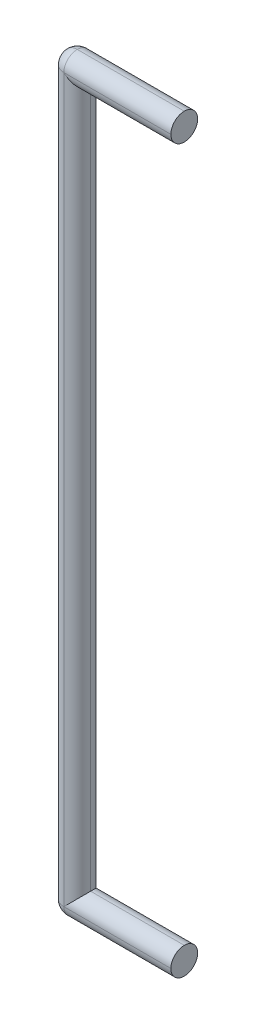
ISO-10303-21;
HEADER;
FILE_DESCRIPTION(('STEP AP214'),'2;1');
FILE_NAME('part.step','',(''),(''),'','','');
FILE_SCHEMA(('AUTOMOTIVE_DESIGN { 1 0 10303 214 1 1 1 1 }'));
ENDSEC;
DATA;
#1=APPLICATION_CONTEXT('core data for automotive mechanical design processes');
#2=APPLICATION_PROTOCOL_DEFINITION('international standard','automotive_design',2000,#1);
#3=PRODUCT_CONTEXT('',#1,'mechanical');
#4=PRODUCT('Part','Part','',(#3));
#5=PRODUCT_RELATED_PRODUCT_CATEGORY('part','',(#4));
#6=PRODUCT_DEFINITION_FORMATION('','',#4);
#7=PRODUCT_DEFINITION_CONTEXT('part definition',#1,'design');
#8=PRODUCT_DEFINITION('design','',#6,#7);
#9=PRODUCT_DEFINITION_SHAPE('','',#8);
#10=(LENGTH_UNIT() NAMED_UNIT(*) SI_UNIT(.MILLI.,.METRE.));
#11=(NAMED_UNIT(*) PLANE_ANGLE_UNIT() SI_UNIT($,.RADIAN.));
#12=(NAMED_UNIT(*) SI_UNIT($,.STERADIAN.) SOLID_ANGLE_UNIT());
#13=UNCERTAINTY_MEASURE_WITH_UNIT(LENGTH_MEASURE(1.E-05),#10,'distance_accuracy_value','');
#14=(GEOMETRIC_REPRESENTATION_CONTEXT(3) GLOBAL_UNCERTAINTY_ASSIGNED_CONTEXT((#13)) GLOBAL_UNIT_ASSIGNED_CONTEXT((#10,
#11,#12)) REPRESENTATION_CONTEXT('',''));
#15=CARTESIAN_POINT('',(0.,0.,0.));
#16=DIRECTION('',(0.,0.,1.));
#17=DIRECTION('',(1.,0.,0.));
#18=AXIS2_PLACEMENT_3D('',#15,#16,#17);
#19=CARTESIAN_POINT('',(4.,0.,0.));
#20=DIRECTION('',(-1.,0.,0.));
#21=DIRECTION('',(0.,0.,1.));
#22=AXIS2_PLACEMENT_3D('',#19,#20,#21);
#23=PLANE('',#22);
#24=CARTESIAN_POINT('',(4.,-0.5,0.));
#25=DIRECTION('',(-1.,0.,0.));
#26=DIRECTION('',(0.,0.,1.));
#27=AXIS2_PLACEMENT_3D('',#24,#25,#26);
#28=CIRCLE('',#27,0.5);
#29=CARTESIAN_POINT('',(4.,0.,0.));
#30=VERTEX_POINT('',#29);
#31=CARTESIAN_POINT('',(4.,-0.5,0.5));
#32=VERTEX_POINT('',#31);
#33=EDGE_CURVE('E109',#30,#32,#28,.F.);
#34=ORIENTED_EDGE('',*,*,#33,.T.);
#35=CARTESIAN_POINT('',(4.,-0.5,0.));
#36=DIRECTION('',(-1.,0.,0.));
#37=DIRECTION('',(0.,0.,1.));
#38=AXIS2_PLACEMENT_3D('',#35,#36,#37);
#39=CIRCLE('',#38,0.5);
#40=CARTESIAN_POINT('',(4.,-1.,0.));
#41=VERTEX_POINT('',#40);
#42=EDGE_CURVE('E113',#32,#41,#39,.F.);
#43=ORIENTED_EDGE('',*,*,#42,.T.);
#44=CARTESIAN_POINT('',(4.,-0.5,0.));
#45=DIRECTION('',(-1.,0.,0.));
#46=DIRECTION('',(0.,0.,1.));
#47=AXIS2_PLACEMENT_3D('',#44,#45,#46);
#48=CIRCLE('',#47,0.5);
#49=CARTESIAN_POINT('',(4.,-0.5,-0.5));
#50=VERTEX_POINT('',#49);
#51=EDGE_CURVE('E149',#41,#50,#48,.F.);
#52=ORIENTED_EDGE('',*,*,#51,.T.);
#53=CARTESIAN_POINT('',(4.,-0.5,0.));
#54=DIRECTION('',(-1.,0.,0.));
#55=DIRECTION('',(0.,0.,1.));
#56=AXIS2_PLACEMENT_3D('',#53,#54,#55);
#57=CIRCLE('',#56,0.5);
#58=EDGE_CURVE('E115',#50,#30,#57,.F.);
#59=ORIENTED_EDGE('',*,*,#58,.T.);
#60=EDGE_LOOP('',(#34,#43,#52,#59));
#61=FACE_BOUND('',#60,.T.);
#62=ADVANCED_FACE('F41',(#61),#23,.F.);
#63=CARTESIAN_POINT('',(4.,0.,0.));
#64=DIRECTION('',(1.,0.,0.));
#65=DIRECTION('',(0.,0.,-1.));
#66=AXIS2_PLACEMENT_3D('',#63,#64,#65);
#67=PLANE('',#66);
#68=CARTESIAN_POINT('',(4.,26.5,0.));
#69=DIRECTION('',(1.,0.,0.));
#70=DIRECTION('',(0.,0.,-1.));
#71=AXIS2_PLACEMENT_3D('',#68,#69,#70);
#72=CIRCLE('',#71,0.5);
#73=CARTESIAN_POINT('',(4.,26.5,-0.499999999999996));
#74=VERTEX_POINT('',#73);
#75=CARTESIAN_POINT('',(4.,27.,0.));
#76=VERTEX_POINT('',#75);
#77=EDGE_CURVE('E163',#74,#76,#72,.T.);
#78=ORIENTED_EDGE('',*,*,#77,.T.);
#79=CARTESIAN_POINT('',(4.,26.5,0.));
#80=DIRECTION('',(1.,0.,0.));
#81=DIRECTION('',(0.,0.,-1.));
#82=AXIS2_PLACEMENT_3D('',#79,#80,#81);
#83=CIRCLE('',#82,0.5);
#84=CARTESIAN_POINT('',(4.,26.5,0.500000000000004));
#85=VERTEX_POINT('',#84);
#86=EDGE_CURVE('E194',#76,#85,#83,.T.);
#87=ORIENTED_EDGE('',*,*,#86,.T.);
#88=CARTESIAN_POINT('',(4.,26.5,0.));
#89=DIRECTION('',(1.,0.,0.));
#90=DIRECTION('',(0.,0.,-1.));
#91=AXIS2_PLACEMENT_3D('',#88,#89,#90);
#92=CIRCLE('',#91,0.5);
#93=CARTESIAN_POINT('',(4.,26.,0.));
#94=VERTEX_POINT('',#93);
#95=EDGE_CURVE('E191',#85,#94,#92,.T.);
#96=ORIENTED_EDGE('',*,*,#95,.T.);
#97=CARTESIAN_POINT('',(4.,26.5,0.));
#98=DIRECTION('',(1.,0.,0.));
#99=DIRECTION('',(0.,0.,-1.));
#100=AXIS2_PLACEMENT_3D('',#97,#98,#99);
#101=CIRCLE('',#100,0.5);
#102=EDGE_CURVE('E188',#94,#74,#101,.T.);
#103=ORIENTED_EDGE('',*,*,#102,.T.);
#104=EDGE_LOOP('',(#78,#87,#96,#103));
#105=FACE_BOUND('',#104,.T.);
#106=ADVANCED_FACE('F249',(#105),#67,.T.);
#107=CARTESIAN_POINT('',(0.5,-0.5,0.));
#108=DIRECTION('',(-1.,0.,0.));
#109=DIRECTION('',(0.,0.,1.));
#110=AXIS2_PLACEMENT_3D('',#107,#108,#109);
#111=CYLINDRICAL_SURFACE('',#110,0.5);
#112=DIRECTION('',(1.,0.,0.));
#113=VECTOR('',#112,1.);
#114=CARTESIAN_POINT('',(0.5,0.,0.));
#115=LINE('',#114,#113);
#116=CARTESIAN_POINT('',(0.5,0.,0.));
#117=VERTEX_POINT('',#116);
#118=EDGE_CURVE('E146',#30,#117,#115,.F.);
#119=ORIENTED_EDGE('',*,*,#118,.F.);
#120=ORIENTED_EDGE('',*,*,#58,.F.);
#121=DIRECTION('',(1.,0.,0.));
#122=VECTOR('',#121,1.);
#123=CARTESIAN_POINT('',(-0.5,-0.5,-0.5));
#124=LINE('',#123,#122);
#125=CARTESIAN_POINT('',(0.,-0.5,-0.5));
#126=VERTEX_POINT('',#125);
#127=EDGE_CURVE('E136',#50,#126,#124,.F.);
#128=ORIENTED_EDGE('',*,*,#127,.T.);
#129=CARTESIAN_POINT('',(0.,-0.5,0.));
#130=DIRECTION('',(0.707106781186547,-0.707106781186547,0.));
#131=DIRECTION('',(-0.707106781186547,-0.707106781186547,0.));
#132=AXIS2_PLACEMENT_3D('',#129,#130,#131);
#133=ELLIPSE('',#132,0.707106781186547,0.5);
#134=EDGE_CURVE('E158',#126,#117,#133,.T.);
#135=ORIENTED_EDGE('',*,*,#134,.T.);
#136=EDGE_LOOP('',(#119,#120,#128,#135));
#137=FACE_BOUND('',#136,.T.);
#138=ADVANCED_FACE('F271',(#137),#111,.T.);
#139=CARTESIAN_POINT('',(-0.5,-0.5,0.));
#140=DIRECTION('',(-1.,0.,0.));
#141=DIRECTION('',(0.,0.,1.));
#142=AXIS2_PLACEMENT_3D('',#139,#140,#141);
#143=CYLINDRICAL_SURFACE('',#142,0.5);
#144=DIRECTION('',(1.,0.,0.));
#145=VECTOR('',#144,1.);
#146=CARTESIAN_POINT('',(4.,-1.,0.));
#147=LINE('',#146,#145);
#148=CARTESIAN_POINT('',(0.,-1.,0.));
#149=VERTEX_POINT('',#148);
#150=EDGE_CURVE('E129',#149,#41,#147,.T.);
#151=ORIENTED_EDGE('',*,*,#150,.F.);
#152=CARTESIAN_POINT('',(0.,-0.5,0.));
#153=DIRECTION('',(-1.,0.,0.));
#154=DIRECTION('',(0.,0.,1.));
#155=AXIS2_PLACEMENT_3D('',#152,#153,#154);
#156=CIRCLE('',#155,0.5);
#157=EDGE_CURVE('E140',#149,#126,#156,.F.);
#158=ORIENTED_EDGE('',*,*,#157,.T.);
#159=ORIENTED_EDGE('',*,*,#127,.F.);
#160=ORIENTED_EDGE('',*,*,#51,.F.);
#161=EDGE_LOOP('',(#151,#158,#159,#160));
#162=FACE_BOUND('',#161,.T.);
#163=ADVANCED_FACE('F279',(#162),#143,.T.);
#164=CARTESIAN_POINT('',(-0.5,-0.5,0.));
#165=DIRECTION('',(-1.,0.,0.));
#166=DIRECTION('',(0.,0.,1.));
#167=AXIS2_PLACEMENT_3D('',#164,#165,#166);
#168=CYLINDRICAL_SURFACE('',#167,0.5);
#169=ORIENTED_EDGE('',*,*,#118,.T.);
#170=CARTESIAN_POINT('',(0.,-0.5,0.));
#171=DIRECTION('',(0.707106781186547,-0.707106781186547,0.));
#172=DIRECTION('',(-0.707106781186547,-0.707106781186547,0.));
#173=AXIS2_PLACEMENT_3D('',#170,#171,#172);
#174=ELLIPSE('',#173,0.707106781186547,0.5);
#175=CARTESIAN_POINT('',(0.,-0.5,0.5));
#176=VERTEX_POINT('',#175);
#177=EDGE_CURVE('E125',#117,#176,#174,.T.);
#178=ORIENTED_EDGE('',*,*,#177,.T.);
#179=DIRECTION('',(1.,0.,0.));
#180=VECTOR('',#179,1.);
#181=CARTESIAN_POINT('',(0.5,-0.5,0.5));
#182=LINE('',#181,#180);
#183=EDGE_CURVE('E122',#32,#176,#182,.F.);
#184=ORIENTED_EDGE('',*,*,#183,.F.);
#185=ORIENTED_EDGE('',*,*,#33,.F.);
#186=EDGE_LOOP('',(#169,#178,#184,#185));
#187=FACE_BOUND('',#186,.T.);
#188=ADVANCED_FACE('F123',(#187),#168,.T.);
#189=CARTESIAN_POINT('',(0.5,-0.5,0.));
#190=DIRECTION('',(-1.,0.,0.));
#191=DIRECTION('',(0.,0.,1.));
#192=AXIS2_PLACEMENT_3D('',#189,#190,#191);
#193=CYLINDRICAL_SURFACE('',#192,0.5);
#194=ORIENTED_EDGE('',*,*,#183,.T.);
#195=CARTESIAN_POINT('',(0.,-0.5,0.));
#196=DIRECTION('',(-1.,0.,0.));
#197=DIRECTION('',(0.,0.,1.));
#198=AXIS2_PLACEMENT_3D('',#195,#196,#197);
#199=CIRCLE('',#198,0.5);
#200=EDGE_CURVE('E153',#176,#149,#199,.F.);
#201=ORIENTED_EDGE('',*,*,#200,.T.);
#202=ORIENTED_EDGE('',*,*,#150,.T.);
#203=ORIENTED_EDGE('',*,*,#42,.F.);
#204=EDGE_LOOP('',(#194,#201,#202,#203));
#205=FACE_BOUND('',#204,.T.);
#206=ADVANCED_FACE('F132',(#205),#193,.T.);
#207=CARTESIAN_POINT('',(0.,26.,0.));
#208=DIRECTION('',(0.,-1.,0.));
#209=DIRECTION('',(0.,0.,-1.));
#210=AXIS2_PLACEMENT_3D('',#207,#208,#209);
#211=CYLINDRICAL_SURFACE('',#210,0.5);
#212=DIRECTION('',(0.,-1.,0.));
#213=VECTOR('',#212,1.);
#214=CARTESIAN_POINT('',(0.,26.,0.5));
#215=LINE('',#214,#213);
#216=CARTESIAN_POINT('',(0.,26.5,0.5));
#217=VERTEX_POINT('',#216);
#218=EDGE_CURVE('E180',#176,#217,#215,.F.);
#219=ORIENTED_EDGE('',*,*,#218,.F.);
#220=ORIENTED_EDGE('',*,*,#177,.F.);
#221=DIRECTION('',(0.,-1.,0.));
#222=VECTOR('',#221,1.);
#223=CARTESIAN_POINT('',(0.5,26.,0.));
#224=LINE('',#223,#222);
#225=CARTESIAN_POINT('',(0.5,26.,0.));
#226=VERTEX_POINT('',#225);
#227=EDGE_CURVE('E130',#226,#117,#224,.T.);
#228=ORIENTED_EDGE('',*,*,#227,.F.);
#229=CARTESIAN_POINT('',(0.,26.5,0.));
#230=DIRECTION('',(-0.707106781186547,-0.707106781186547,0.));
#231=DIRECTION('',(-0.707106781186547,0.707106781186547,0.));
#232=AXIS2_PLACEMENT_3D('',#229,#230,#231);
#233=ELLIPSE('',#232,0.707106781186547,0.5);
#234=EDGE_CURVE('E52',#226,#217,#233,.T.);
#235=ORIENTED_EDGE('',*,*,#234,.T.);
#236=EDGE_LOOP('',(#219,#220,#228,#235));
#237=FACE_BOUND('',#236,.T.);
#238=ADVANCED_FACE('F276',(#237),#211,.T.);
#239=CARTESIAN_POINT('',(0.,26.,0.));
#240=DIRECTION('',(0.,-1.,0.));
#241=DIRECTION('',(0.,0.,-1.));
#242=AXIS2_PLACEMENT_3D('',#239,#240,#241);
#243=CYLINDRICAL_SURFACE('',#242,0.5);
#244=ORIENTED_EDGE('',*,*,#227,.T.);
#245=ORIENTED_EDGE('',*,*,#134,.F.);
#246=DIRECTION('',(0.,-1.,0.));
#247=VECTOR('',#246,1.);
#248=CARTESIAN_POINT('',(0.,26.,-0.5));
#249=LINE('',#248,#247);
#250=CARTESIAN_POINT('',(0.,26.5,-0.5));
#251=VERTEX_POINT('',#250);
#252=EDGE_CURVE('E59',#126,#251,#249,.F.);
#253=ORIENTED_EDGE('',*,*,#252,.T.);
#254=CARTESIAN_POINT('',(0.,26.5,0.));
#255=DIRECTION('',(-0.707106781186547,-0.707106781186547,0.));
#256=DIRECTION('',(-0.707106781186547,0.707106781186547,0.));
#257=AXIS2_PLACEMENT_3D('',#254,#255,#256);
#258=ELLIPSE('',#257,0.707106781186547,0.5);
#259=EDGE_CURVE('E11',#251,#226,#258,.T.);
#260=ORIENTED_EDGE('',*,*,#259,.T.);
#261=EDGE_LOOP('',(#244,#245,#253,#260));
#262=FACE_BOUND('',#261,.T.);
#263=ADVANCED_FACE('F301',(#262),#243,.T.);
#264=CARTESIAN_POINT('',(0.,26.,0.));
#265=DIRECTION('',(0.,-1.,0.));
#266=DIRECTION('',(0.,0.,-1.));
#267=AXIS2_PLACEMENT_3D('',#264,#265,#266);
#268=CYLINDRICAL_SURFACE('',#267,0.5);
#269=ORIENTED_EDGE('',*,*,#218,.T.);
#270=CARTESIAN_POINT('',(0.,26.5,0.));
#271=DIRECTION('',(0.,-1.,0.));
#272=DIRECTION('',(0.,0.,-1.));
#273=AXIS2_PLACEMENT_3D('',#270,#271,#272);
#274=CIRCLE('',#273,0.5);
#275=CARTESIAN_POINT('',(-0.5,26.5,0.));
#276=VERTEX_POINT('',#275);
#277=EDGE_CURVE('E198',#217,#276,#274,.T.);
#278=ORIENTED_EDGE('',*,*,#277,.T.);
#279=DIRECTION('',(0.,-1.,0.));
#280=VECTOR('',#279,1.);
#281=CARTESIAN_POINT('',(-0.5,26.,0.));
#282=LINE('',#281,#280);
#283=CARTESIAN_POINT('',(-0.5,-0.5,0.));
#284=VERTEX_POINT('',#283);
#285=EDGE_CURVE('E176',#284,#276,#282,.F.);
#286=ORIENTED_EDGE('',*,*,#285,.F.);
#287=CARTESIAN_POINT('',(0.,-0.5,0.));
#288=DIRECTION('',(0.,-1.,0.));
#289=DIRECTION('',(0.,0.,-1.));
#290=AXIS2_PLACEMENT_3D('',#287,#288,#289);
#291=CIRCLE('',#290,0.5);
#292=EDGE_CURVE('E172',#176,#284,#291,.T.);
#293=ORIENTED_EDGE('',*,*,#292,.F.);
#294=EDGE_LOOP('',(#269,#278,#286,#293));
#295=FACE_BOUND('',#294,.T.);
#296=ADVANCED_FACE('F297',(#295),#268,.T.);
#297=CARTESIAN_POINT('',(0.,26.,0.));
#298=DIRECTION('',(0.,-1.,0.));
#299=DIRECTION('',(0.,0.,-1.));
#300=AXIS2_PLACEMENT_3D('',#297,#298,#299);
#301=CYLINDRICAL_SURFACE('',#300,0.5);
#302=ORIENTED_EDGE('',*,*,#285,.T.);
#303=CARTESIAN_POINT('',(0.,26.5,0.));
#304=DIRECTION('',(0.,-1.,0.));
#305=DIRECTION('',(0.,0.,-1.));
#306=AXIS2_PLACEMENT_3D('',#303,#304,#305);
#307=CIRCLE('',#306,0.5);
#308=EDGE_CURVE('E202',#276,#251,#307,.T.);
#309=ORIENTED_EDGE('',*,*,#308,.T.);
#310=ORIENTED_EDGE('',*,*,#252,.F.);
#311=CARTESIAN_POINT('',(0.,-0.5,0.));
#312=DIRECTION('',(0.,-1.,0.));
#313=DIRECTION('',(0.,0.,-1.));
#314=AXIS2_PLACEMENT_3D('',#311,#312,#313);
#315=CIRCLE('',#314,0.5);
#316=EDGE_CURVE('E168',#284,#126,#315,.T.);
#317=ORIENTED_EDGE('',*,*,#316,.F.);
#318=EDGE_LOOP('',(#302,#309,#310,#317));
#319=FACE_BOUND('',#318,.T.);
#320=ADVANCED_FACE('F293',(#319),#301,.T.);
#321=CARTESIAN_POINT('',(0.,-0.5,0.));
#322=DIRECTION('',(1.,0.,0.));
#323=DIRECTION('',(0.,0.,-1.));
#324=AXIS2_PLACEMENT_3D('',#321,#322,#323);
#325=SPHERICAL_SURFACE('',#324,0.5);
#326=ORIENTED_EDGE('',*,*,#200,.F.);
#327=ORIENTED_EDGE('',*,*,#292,.T.);
#328=CARTESIAN_POINT('',(0.,-0.5,0.));
#329=DIRECTION('',(0.,0.,-1.));
#330=DIRECTION('',(0.,1.,0.));
#331=AXIS2_PLACEMENT_3D('',#328,#329,#330);
#332=CIRCLE('',#331,0.5);
#333=EDGE_CURVE('E164',#149,#284,#332,.T.);
#334=ORIENTED_EDGE('',*,*,#333,.F.);
#335=EDGE_LOOP('',(#326,#327,#334));
#336=FACE_BOUND('',#335,.T.);
#337=ADVANCED_FACE('F289',(#336),#325,.T.);
#338=CARTESIAN_POINT('',(0.,-0.5,0.));
#339=DIRECTION('',(1.,0.,0.));
#340=DIRECTION('',(0.,0.,-1.));
#341=AXIS2_PLACEMENT_3D('',#338,#339,#340);
#342=SPHERICAL_SURFACE('',#341,0.5);
#343=ORIENTED_EDGE('',*,*,#316,.T.);
#344=ORIENTED_EDGE('',*,*,#157,.F.);
#345=ORIENTED_EDGE('',*,*,#333,.T.);
#346=EDGE_LOOP('',(#343,#344,#345));
#347=FACE_BOUND('',#346,.T.);
#348=ADVANCED_FACE('F286',(#347),#342,.T.);
#349=CARTESIAN_POINT('',(0.,26.5,0.));
#350=DIRECTION('',(0.,1.,0.));
#351=DIRECTION('',(0.,0.,1.));
#352=AXIS2_PLACEMENT_3D('',#349,#350,#351);
#353=SPHERICAL_SURFACE('',#352,0.5);
#354=CARTESIAN_POINT('',(0.,26.5,0.));
#355=DIRECTION('',(1.,0.,0.));
#356=DIRECTION('',(0.,0.,-1.));
#357=AXIS2_PLACEMENT_3D('',#354,#355,#356);
#358=CIRCLE('',#357,0.5);
#359=CARTESIAN_POINT('',(0.,27.,0.));
#360=VERTEX_POINT('',#359);
#361=EDGE_CURVE('E223',#251,#360,#358,.T.);
#362=ORIENTED_EDGE('',*,*,#361,.F.);
#363=ORIENTED_EDGE('',*,*,#308,.F.);
#364=CARTESIAN_POINT('',(0.,26.5,0.));
#365=DIRECTION('',(0.,0.,1.));
#366=DIRECTION('',(1.,0.,0.));
#367=AXIS2_PLACEMENT_3D('',#364,#365,#366);
#368=CIRCLE('',#367,0.5);
#369=EDGE_CURVE('E226',#360,#276,#368,.T.);
#370=ORIENTED_EDGE('',*,*,#369,.F.);
#371=EDGE_LOOP('',(#362,#363,#370));
#372=FACE_BOUND('',#371,.T.);
#373=ADVANCED_FACE('F43',(#372),#353,.T.);
#374=CARTESIAN_POINT('',(-0.5,26.5,0.));
#375=DIRECTION('',(-1.,0.,0.));
#376=DIRECTION('',(0.,0.,1.));
#377=AXIS2_PLACEMENT_3D('',#374,#375,#376);
#378=CYLINDRICAL_SURFACE('',#377,0.5);
#379=DIRECTION('',(1.,0.,0.));
#380=VECTOR('',#379,1.);
#381=CARTESIAN_POINT('',(0.,26.5,-0.5));
#382=LINE('',#381,#380);
#383=EDGE_CURVE('E219',#74,#251,#382,.F.);
#384=ORIENTED_EDGE('',*,*,#383,.F.);
#385=ORIENTED_EDGE('',*,*,#102,.F.);
#386=DIRECTION('',(1.,0.,0.));
#387=VECTOR('',#386,1.);
#388=CARTESIAN_POINT('',(4.,26.,0.));
#389=LINE('',#388,#387);
#390=EDGE_CURVE('E45',#226,#94,#389,.T.);
#391=ORIENTED_EDGE('',*,*,#390,.F.);
#392=ORIENTED_EDGE('',*,*,#259,.F.);
#393=EDGE_LOOP('',(#384,#385,#391,#392));
#394=FACE_BOUND('',#393,.T.);
#395=ADVANCED_FACE('F245',(#394),#378,.T.);
#396=CARTESIAN_POINT('',(0.5,26.5,0.));
#397=DIRECTION('',(-1.,0.,0.));
#398=DIRECTION('',(0.,0.,1.));
#399=AXIS2_PLACEMENT_3D('',#396,#397,#398);
#400=CYLINDRICAL_SURFACE('',#399,0.5);
#401=ORIENTED_EDGE('',*,*,#390,.T.);
#402=ORIENTED_EDGE('',*,*,#95,.F.);
#403=DIRECTION('',(1.,0.,0.));
#404=VECTOR('',#403,1.);
#405=CARTESIAN_POINT('',(4.,26.5,0.5));
#406=LINE('',#405,#404);
#407=EDGE_CURVE('E216',#217,#85,#406,.T.);
#408=ORIENTED_EDGE('',*,*,#407,.F.);
#409=ORIENTED_EDGE('',*,*,#234,.F.);
#410=EDGE_LOOP('',(#401,#402,#408,#409));
#411=FACE_BOUND('',#410,.T.);
#412=ADVANCED_FACE('F239',(#411),#400,.T.);
#413=CARTESIAN_POINT('',(0.,26.5,0.));
#414=DIRECTION('',(0.,1.,0.));
#415=DIRECTION('',(0.,0.,1.));
#416=AXIS2_PLACEMENT_3D('',#413,#414,#415);
#417=SPHERICAL_SURFACE('',#416,0.5);
#418=ORIENTED_EDGE('',*,*,#369,.T.);
#419=ORIENTED_EDGE('',*,*,#277,.F.);
#420=CARTESIAN_POINT('',(0.,26.5,0.));
#421=DIRECTION('',(1.,0.,0.));
#422=DIRECTION('',(0.,0.,-1.));
#423=AXIS2_PLACEMENT_3D('',#420,#421,#422);
#424=CIRCLE('',#423,0.5);
#425=EDGE_CURVE('E212',#360,#217,#424,.T.);
#426=ORIENTED_EDGE('',*,*,#425,.F.);
#427=EDGE_LOOP('',(#418,#419,#426));
#428=FACE_BOUND('',#427,.T.);
#429=ADVANCED_FACE('F254',(#428),#417,.T.);
#430=CARTESIAN_POINT('',(0.5,26.5,0.));
#431=DIRECTION('',(-1.,0.,0.));
#432=DIRECTION('',(0.,0.,1.));
#433=AXIS2_PLACEMENT_3D('',#430,#431,#432);
#434=CYLINDRICAL_SURFACE('',#433,0.5);
#435=ORIENTED_EDGE('',*,*,#383,.T.);
#436=ORIENTED_EDGE('',*,*,#361,.T.);
#437=DIRECTION('',(1.,0.,0.));
#438=VECTOR('',#437,1.);
#439=CARTESIAN_POINT('',(0.,27.,0.));
#440=LINE('',#439,#438);
#441=EDGE_CURVE('E208',#76,#360,#440,.F.);
#442=ORIENTED_EDGE('',*,*,#441,.F.);
#443=ORIENTED_EDGE('',*,*,#77,.F.);
#444=EDGE_LOOP('',(#435,#436,#442,#443));
#445=FACE_BOUND('',#444,.T.);
#446=ADVANCED_FACE('F257',(#445),#434,.T.);
#447=CARTESIAN_POINT('',(-0.5,26.5,0.));
#448=DIRECTION('',(-1.,0.,0.));
#449=DIRECTION('',(0.,0.,1.));
#450=AXIS2_PLACEMENT_3D('',#447,#448,#449);
#451=CYLINDRICAL_SURFACE('',#450,0.5);
#452=ORIENTED_EDGE('',*,*,#425,.T.);
#453=ORIENTED_EDGE('',*,*,#407,.T.);
#454=ORIENTED_EDGE('',*,*,#86,.F.);
#455=ORIENTED_EDGE('',*,*,#441,.T.);
#456=EDGE_LOOP('',(#452,#453,#454,#455));
#457=FACE_BOUND('',#456,.T.);
#458=ADVANCED_FACE('F253',(#457),#451,.T.);
#459=CLOSED_SHELL('',(#62,#106,#138,#163,#188,#206,#238,#263,#296,#320,#337,#348,#373,#395,#412,
#429,#446,#458));
#460=MANIFOLD_SOLID_BREP('B2',#459);
#461=ADVANCED_BREP_SHAPE_REPRESENTATION('',(#18,#460),#14);
#462=SHAPE_DEFINITION_REPRESENTATION(#9,#461);
ENDSEC;
END-ISO-10303-21;
